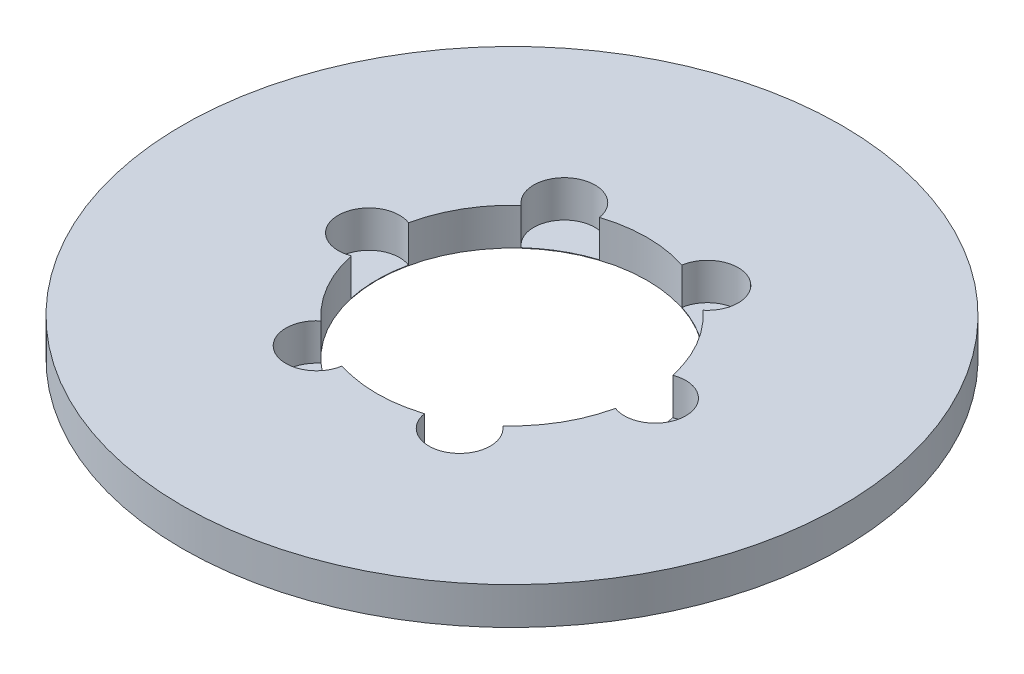
ISO-10303-21;
HEADER;
FILE_DESCRIPTION(('STEP AP214'),'2;1');
FILE_NAME('part.step','',(''),(''),'','','');
FILE_SCHEMA(('AUTOMOTIVE_DESIGN { 1 0 10303 214 1 1 1 1 }'));
ENDSEC;
DATA;
#1=APPLICATION_CONTEXT('core data for automotive mechanical design processes');
#2=APPLICATION_PROTOCOL_DEFINITION('international standard','automotive_design',2000,#1);
#3=PRODUCT_CONTEXT('',#1,'mechanical');
#4=PRODUCT('Part','Part','',(#3));
#5=PRODUCT_RELATED_PRODUCT_CATEGORY('part','',(#4));
#6=PRODUCT_DEFINITION_FORMATION('','',#4);
#7=PRODUCT_DEFINITION_CONTEXT('part definition',#1,'design');
#8=PRODUCT_DEFINITION('design','',#6,#7);
#9=PRODUCT_DEFINITION_SHAPE('','',#8);
#10=(LENGTH_UNIT() NAMED_UNIT(*) SI_UNIT(.MILLI.,.METRE.));
#11=(NAMED_UNIT(*) PLANE_ANGLE_UNIT() SI_UNIT($,.RADIAN.));
#12=(NAMED_UNIT(*) SI_UNIT($,.STERADIAN.) SOLID_ANGLE_UNIT());
#13=UNCERTAINTY_MEASURE_WITH_UNIT(LENGTH_MEASURE(1.E-05),#10,'distance_accuracy_value','');
#14=(GEOMETRIC_REPRESENTATION_CONTEXT(3) GLOBAL_UNCERTAINTY_ASSIGNED_CONTEXT((#13)) GLOBAL_UNIT_ASSIGNED_CONTEXT((#10,
#11,#12)) REPRESENTATION_CONTEXT('',''));
#15=CARTESIAN_POINT('',(0.,0.,0.));
#16=DIRECTION('',(0.,0.,1.));
#17=DIRECTION('',(1.,0.,0.));
#18=AXIS2_PLACEMENT_3D('',#15,#16,#17);
#19=CARTESIAN_POINT('',(0.,11.,0.));
#20=DIRECTION('',(0.,-1.,0.));
#21=DIRECTION('',(0.,0.,-1.));
#22=AXIS2_PLACEMENT_3D('',#19,#20,#21);
#23=CYLINDRICAL_SURFACE('',#22,97.5);
#24=CARTESIAN_POINT('',(0.,11.,0.));
#25=DIRECTION('',(0.,1.,0.));
#26=DIRECTION('',(0.,0.,1.));
#27=AXIS2_PLACEMENT_3D('',#24,#25,#26);
#28=CIRCLE('',#27,97.5);
#29=CARTESIAN_POINT('',(0.,11.,97.5));
#30=VERTEX_POINT('',#29);
#31=EDGE_CURVE('E171',#30,#30,#28,.T.);
#32=ORIENTED_EDGE('',*,*,#31,.F.);
#33=EDGE_LOOP('',(#32));
#34=FACE_BOUND('',#33,.T.);
#35=CARTESIAN_POINT('',(0.,0.,0.));
#36=DIRECTION('',(0.,1.,0.));
#37=DIRECTION('',(0.,0.,1.));
#38=AXIS2_PLACEMENT_3D('',#35,#36,#37);
#39=CIRCLE('',#38,97.5);
#40=CARTESIAN_POINT('',(0.,0.,97.5));
#41=VERTEX_POINT('',#40);
#42=EDGE_CURVE('E157',#41,#41,#39,.T.);
#43=ORIENTED_EDGE('',*,*,#42,.T.);
#44=EDGE_LOOP('',(#43));
#45=FACE_BOUND('',#44,.T.);
#46=ADVANCED_FACE('F39',(#34,#45),#23,.T.);
#47=CARTESIAN_POINT('',(0.,11.,0.));
#48=DIRECTION('',(0.,1.,0.));
#49=DIRECTION('',(0.,0.,1.));
#50=AXIS2_PLACEMENT_3D('',#47,#48,#49);
#51=PLANE('',#50);
#52=CARTESIAN_POINT('',(-21.1661389337115,11.,-36.660828033249));
#53=DIRECTION('',(0.,1.,0.));
#54=DIRECTION('',(-0.866025403784433,0.,0.50000000000001));
#55=AXIS2_PLACEMENT_3D('',#52,#53,#54);
#56=CIRCLE('',#55,9.07629285510067);
#57=CARTESIAN_POINT('',(-12.2035447762373,11.,-38.0929585999089));
#58=VERTEX_POINT('',#57);
#59=CARTESIAN_POINT('',(-26.887697464712,11.,-29.6150590923962));
#60=VERTEX_POINT('',#59);
#61=EDGE_CURVE('E214',#58,#60,#56,.T.);
#62=ORIENTED_EDGE('',*,*,#61,.F.);
#63=CARTESIAN_POINT('',(0.,11.,0.));
#64=DIRECTION('',(0.,1.,0.));
#65=DIRECTION('',(0.,0.,1.));
#66=AXIS2_PLACEMENT_3D('',#63,#64,#65);
#67=CIRCLE('',#66,40.);
#68=CARTESIAN_POINT('',(12.2035447762365,11.,-38.0929585999091));
#69=VERTEX_POINT('',#68);
#70=EDGE_CURVE('E272',#69,#58,#67,.T.);
#71=ORIENTED_EDGE('',*,*,#70,.F.);
#72=CARTESIAN_POINT('',(21.1661389337107,11.,-36.6608280332494));
#73=DIRECTION('',(0.,1.,0.));
#74=DIRECTION('',(-0.866025403784443,0.,-0.499999999999992));
#75=AXIS2_PLACEMENT_3D('',#72,#73,#74);
#76=CIRCLE('',#75,9.07629285510067);
#77=CARTESIAN_POINT('',(26.8876974647114,11.,-29.6150590923968));
#78=VERTEX_POINT('',#77);
#79=EDGE_CURVE('E285',#78,#69,#76,.T.);
#80=ORIENTED_EDGE('',*,*,#79,.F.);
#81=CARTESIAN_POINT('',(39.0912422409485,11.,-8.47789950751251));
#82=VERTEX_POINT('',#81);
#83=EDGE_CURVE('E165',#82,#78,#67,.T.);
#84=ORIENTED_EDGE('',*,*,#83,.F.);
#85=CARTESIAN_POINT('',(42.3322778674221,11.,0.));
#86=DIRECTION('',(0.,1.,0.));
#87=DIRECTION('',(0.,0.,-1.));
#88=AXIS2_PLACEMENT_3D('',#85,#86,#87);
#89=CIRCLE('',#88,9.07629285510067);
#90=CARTESIAN_POINT('',(39.0912422409485,11.,8.47789950751251));
#91=VERTEX_POINT('',#90);
#92=EDGE_CURVE('E281',#91,#82,#89,.T.);
#93=ORIENTED_EDGE('',*,*,#92,.F.);
#94=CARTESIAN_POINT('',(26.8876974647118,11.,29.6150590923964));
#95=VERTEX_POINT('',#94);
#96=EDGE_CURVE('E160',#95,#91,#67,.T.);
#97=ORIENTED_EDGE('',*,*,#96,.F.);
#98=CARTESIAN_POINT('',(21.1661389337112,11.,36.6608280332492));
#99=DIRECTION('',(0.,1.,0.));
#100=DIRECTION('',(0.866025403784436,0.,-0.500000000000004));
#101=AXIS2_PLACEMENT_3D('',#98,#99,#100);
#102=CIRCLE('',#101,9.07629285510067);
#103=CARTESIAN_POINT('',(12.203544776237,11.,38.092958599909));
#104=VERTEX_POINT('',#103);
#105=EDGE_CURVE('E154',#104,#95,#102,.T.);
#106=ORIENTED_EDGE('',*,*,#105,.F.);
#107=CARTESIAN_POINT('',(-12.2035447762368,11.,38.092958599909));
#108=VERTEX_POINT('',#107);
#109=EDGE_CURVE('E150',#108,#104,#67,.T.);
#110=ORIENTED_EDGE('',*,*,#109,.F.);
#111=CARTESIAN_POINT('',(-21.166138933711,11.,36.6608280332493));
#112=DIRECTION('',(0.,1.,0.));
#113=DIRECTION('',(0.86602540378444,0.,0.499999999999998));
#114=AXIS2_PLACEMENT_3D('',#111,#112,#113);
#115=CIRCLE('',#114,9.07629285510067);
#116=CARTESIAN_POINT('',(-26.8876974647116,11.,29.6150590923966));
#117=VERTEX_POINT('',#116);
#118=EDGE_CURVE('E127',#117,#108,#115,.T.);
#119=ORIENTED_EDGE('',*,*,#118,.F.);
#120=CARTESIAN_POINT('',(-39.0912422409485,11.,8.47789950751251));
#121=VERTEX_POINT('',#120);
#122=EDGE_CURVE('E156',#121,#117,#67,.T.);
#123=ORIENTED_EDGE('',*,*,#122,.F.);
#124=CARTESIAN_POINT('',(-42.3322778674221,11.,0.));
#125=DIRECTION('',(0.,1.,0.));
#126=DIRECTION('',(0.,0.,1.));
#127=AXIS2_PLACEMENT_3D('',#124,#125,#126);
#128=CIRCLE('',#127,9.07629285510067);
#129=CARTESIAN_POINT('',(-39.0912422409485,11.,-8.47789950751251));
#130=VERTEX_POINT('',#129);
#131=EDGE_CURVE('E164',#130,#121,#128,.T.);
#132=ORIENTED_EDGE('',*,*,#131,.F.);
#133=EDGE_CURVE('E159',#60,#130,#67,.T.);
#134=ORIENTED_EDGE('',*,*,#133,.F.);
#135=EDGE_LOOP('',(#62,#71,#80,#84,#93,#97,#106,#110,#119,#123,#132,#134));
#136=FACE_BOUND('',#135,.T.);
#137=ORIENTED_EDGE('',*,*,#31,.T.);
#138=EDGE_LOOP('',(#137));
#139=FACE_BOUND('',#138,.T.);
#140=ADVANCED_FACE('F155',(#136,#139),#51,.T.);
#141=CARTESIAN_POINT('',(0.,0.,0.));
#142=DIRECTION('',(0.,1.,0.));
#143=DIRECTION('',(0.,0.,1.));
#144=AXIS2_PLACEMENT_3D('',#141,#142,#143);
#145=PLANE('',#144);
#146=CARTESIAN_POINT('',(0.,0.,0.));
#147=DIRECTION('',(0.,1.,0.));
#148=DIRECTION('',(0.,0.,1.));
#149=AXIS2_PLACEMENT_3D('',#146,#147,#148);
#150=CIRCLE('',#149,40.);
#151=CARTESIAN_POINT('',(0.,0.,40.));
#152=VERTEX_POINT('',#151);
#153=EDGE_CURVE('E170',#152,#152,#150,.T.);
#154=ORIENTED_EDGE('',*,*,#153,.T.);
#155=EDGE_LOOP('',(#154));
#156=FACE_BOUND('',#155,.T.);
#157=ORIENTED_EDGE('',*,*,#42,.F.);
#158=EDGE_LOOP('',(#157));
#159=FACE_BOUND('',#158,.T.);
#160=ADVANCED_FACE('F232',(#156,#159),#145,.F.);
#161=CARTESIAN_POINT('',(0.,11.,0.));
#162=DIRECTION('',(0.,-1.,0.));
#163=DIRECTION('',(0.,0.,-1.));
#164=AXIS2_PLACEMENT_3D('',#161,#162,#163);
#165=CYLINDRICAL_SURFACE('',#164,40.);
#166=DIRECTION('',(0.,1.,0.));
#167=VECTOR('',#166,1.);
#168=CARTESIAN_POINT('',(-12.2035447762373,5.56726037191285,-38.0929585999089));
#169=LINE('',#168,#167);
#170=CARTESIAN_POINT('',(-12.2035447762373,0.134520743825707,-38.0929585999089));
#171=VERTEX_POINT('',#170);
#172=EDGE_CURVE('E11',#171,#58,#169,.T.);
#173=ORIENTED_EDGE('',*,*,#172,.F.);
#174=CARTESIAN_POINT('',(0.,0.134520743825707,0.));
#175=DIRECTION('',(0.,1.,0.));
#176=DIRECTION('',(0.,0.,1.));
#177=AXIS2_PLACEMENT_3D('',#174,#175,#176);
#178=CIRCLE('',#177,40.);
#179=CARTESIAN_POINT('',(-26.887697464712,0.134520743825707,-29.6150590923962));
#180=VERTEX_POINT('',#179);
#181=EDGE_CURVE('E209',#171,#180,#178,.T.);
#182=ORIENTED_EDGE('',*,*,#181,.T.);
#183=DIRECTION('',(0.,1.,0.));
#184=VECTOR('',#183,1.);
#185=CARTESIAN_POINT('',(-26.887697464712,5.56726037191285,-29.6150590923962));
#186=LINE('',#185,#184);
#187=EDGE_CURVE('E46',#60,#180,#186,.F.);
#188=ORIENTED_EDGE('',*,*,#187,.F.);
#189=ORIENTED_EDGE('',*,*,#133,.T.);
#190=DIRECTION('',(0.,1.,0.));
#191=VECTOR('',#190,1.);
#192=CARTESIAN_POINT('',(-39.0912422409485,5.56726037191285,-8.47789950751251));
#193=LINE('',#192,#191);
#194=CARTESIAN_POINT('',(-39.0912422409485,0.134520743825707,-8.47789950751251));
#195=VERTEX_POINT('',#194);
#196=EDGE_CURVE('E185',#195,#130,#193,.T.);
#197=ORIENTED_EDGE('',*,*,#196,.F.);
#198=CARTESIAN_POINT('',(0.,0.134520743825707,0.));
#199=DIRECTION('',(0.,1.,0.));
#200=DIRECTION('',(0.,0.,1.));
#201=AXIS2_PLACEMENT_3D('',#198,#199,#200);
#202=CIRCLE('',#201,40.);
#203=CARTESIAN_POINT('',(-39.0912422409485,0.134520743825707,8.47789950751251));
#204=VERTEX_POINT('',#203);
#205=EDGE_CURVE('E173',#195,#204,#202,.T.);
#206=ORIENTED_EDGE('',*,*,#205,.T.);
#207=DIRECTION('',(0.,1.,0.));
#208=VECTOR('',#207,1.);
#209=CARTESIAN_POINT('',(-39.0912422409485,5.56726037191285,8.47789950751251));
#210=LINE('',#209,#208);
#211=EDGE_CURVE('E178',#121,#204,#210,.F.);
#212=ORIENTED_EDGE('',*,*,#211,.F.);
#213=ORIENTED_EDGE('',*,*,#122,.T.);
#214=DIRECTION('',(0.,1.,0.));
#215=VECTOR('',#214,1.);
#216=CARTESIAN_POINT('',(-26.8876974647116,5.56726037191285,29.6150590923966));
#217=LINE('',#216,#215);
#218=CARTESIAN_POINT('',(-26.8876974647116,0.134520743825707,29.6150590923966));
#219=VERTEX_POINT('',#218);
#220=EDGE_CURVE('E132',#219,#117,#217,.T.);
#221=ORIENTED_EDGE('',*,*,#220,.F.);
#222=CARTESIAN_POINT('',(0.,0.134520743825707,0.));
#223=DIRECTION('',(0.,1.,0.));
#224=DIRECTION('',(0.,0.,1.));
#225=AXIS2_PLACEMENT_3D('',#222,#223,#224);
#226=CIRCLE('',#225,40.);
#227=CARTESIAN_POINT('',(-12.2035447762368,0.134520743825707,38.092958599909));
#228=VERTEX_POINT('',#227);
#229=EDGE_CURVE('E146',#219,#228,#226,.T.);
#230=ORIENTED_EDGE('',*,*,#229,.T.);
#231=DIRECTION('',(0.,1.,0.));
#232=VECTOR('',#231,1.);
#233=CARTESIAN_POINT('',(-12.2035447762368,5.56726037191285,38.092958599909));
#234=LINE('',#233,#232);
#235=EDGE_CURVE('E128',#108,#228,#234,.F.);
#236=ORIENTED_EDGE('',*,*,#235,.F.);
#237=ORIENTED_EDGE('',*,*,#109,.T.);
#238=DIRECTION('',(0.,1.,0.));
#239=VECTOR('',#238,1.);
#240=CARTESIAN_POINT('',(12.203544776237,5.56726037191285,38.092958599909));
#241=LINE('',#240,#239);
#242=CARTESIAN_POINT('',(12.203544776237,0.134520743825707,38.092958599909));
#243=VERTEX_POINT('',#242);
#244=EDGE_CURVE('E192',#243,#104,#241,.T.);
#245=ORIENTED_EDGE('',*,*,#244,.F.);
#246=CARTESIAN_POINT('',(0.,0.134520743825707,0.));
#247=DIRECTION('',(0.,1.,0.));
#248=DIRECTION('',(0.,0.,1.));
#249=AXIS2_PLACEMENT_3D('',#246,#247,#248);
#250=CIRCLE('',#249,40.);
#251=CARTESIAN_POINT('',(26.8876974647118,0.134520743825707,29.6150590923964));
#252=VERTEX_POINT('',#251);
#253=EDGE_CURVE('E190',#243,#252,#250,.T.);
#254=ORIENTED_EDGE('',*,*,#253,.T.);
#255=DIRECTION('',(0.,1.,0.));
#256=VECTOR('',#255,1.);
#257=CARTESIAN_POINT('',(26.8876974647118,5.56726037191285,29.6150590923964));
#258=LINE('',#257,#256);
#259=EDGE_CURVE('E189',#95,#252,#258,.F.);
#260=ORIENTED_EDGE('',*,*,#259,.F.);
#261=ORIENTED_EDGE('',*,*,#96,.T.);
#262=DIRECTION('',(0.,1.,0.));
#263=VECTOR('',#262,1.);
#264=CARTESIAN_POINT('',(39.0912422409485,5.56726037191285,8.47789950751251));
#265=LINE('',#264,#263);
#266=CARTESIAN_POINT('',(39.0912422409485,0.134520743825707,8.47789950751251));
#267=VERTEX_POINT('',#266);
#268=EDGE_CURVE('E203',#267,#91,#265,.T.);
#269=ORIENTED_EDGE('',*,*,#268,.F.);
#270=CARTESIAN_POINT('',(0.,0.134520743825707,0.));
#271=DIRECTION('',(0.,1.,0.));
#272=DIRECTION('',(0.,0.,1.));
#273=AXIS2_PLACEMENT_3D('',#270,#271,#272);
#274=CIRCLE('',#273,40.);
#275=CARTESIAN_POINT('',(39.0912422409485,0.134520743825707,-8.47789950751251));
#276=VERTEX_POINT('',#275);
#277=EDGE_CURVE('E194',#267,#276,#274,.T.);
#278=ORIENTED_EDGE('',*,*,#277,.T.);
#279=DIRECTION('',(0.,1.,0.));
#280=VECTOR('',#279,1.);
#281=CARTESIAN_POINT('',(39.0912422409485,5.56726037191285,-8.47789950751251));
#282=LINE('',#281,#280);
#283=EDGE_CURVE('E196',#82,#276,#282,.F.);
#284=ORIENTED_EDGE('',*,*,#283,.F.);
#285=ORIENTED_EDGE('',*,*,#83,.T.);
#286=DIRECTION('',(0.,1.,0.));
#287=VECTOR('',#286,1.);
#288=CARTESIAN_POINT('',(26.8876974647114,5.56726037191285,-29.6150590923968));
#289=LINE('',#288,#287);
#290=CARTESIAN_POINT('',(26.8876974647114,0.134520743825707,-29.6150590923968));
#291=VERTEX_POINT('',#290);
#292=EDGE_CURVE('E208',#291,#78,#289,.T.);
#293=ORIENTED_EDGE('',*,*,#292,.F.);
#294=CARTESIAN_POINT('',(0.,0.134520743825707,0.));
#295=DIRECTION('',(0.,1.,0.));
#296=DIRECTION('',(0.,0.,1.));
#297=AXIS2_PLACEMENT_3D('',#294,#295,#296);
#298=CIRCLE('',#297,40.);
#299=CARTESIAN_POINT('',(12.2035447762365,0.134520743825707,-38.0929585999091));
#300=VERTEX_POINT('',#299);
#301=EDGE_CURVE('E201',#291,#300,#298,.T.);
#302=ORIENTED_EDGE('',*,*,#301,.T.);
#303=DIRECTION('',(0.,1.,0.));
#304=VECTOR('',#303,1.);
#305=CARTESIAN_POINT('',(12.2035447762365,5.56726037191285,-38.0929585999091));
#306=LINE('',#305,#304);
#307=EDGE_CURVE('E206',#69,#300,#306,.F.);
#308=ORIENTED_EDGE('',*,*,#307,.F.);
#309=ORIENTED_EDGE('',*,*,#70,.T.);
#310=EDGE_LOOP('',(#173,#182,#188,#189,#197,#206,#212,#213,#221,#230,#236,#237,#245,#254,#260,
#261,#269,#278,#284,#285,#293,#302,#308,#309));
#311=FACE_BOUND('',#310,.T.);
#312=ORIENTED_EDGE('',*,*,#153,.F.);
#313=EDGE_LOOP('',(#312));
#314=FACE_BOUND('',#313,.T.);
#315=ADVANCED_FACE('F145',(#311,#314),#165,.F.);
#316=CARTESIAN_POINT('',(-42.3322778674221,0.134520743825707,0.));
#317=DIRECTION('',(0.,1.,0.));
#318=DIRECTION('',(0.,0.,1.));
#319=AXIS2_PLACEMENT_3D('',#316,#317,#318);
#320=CYLINDRICAL_SURFACE('',#319,9.07629285510067);
#321=ORIENTED_EDGE('',*,*,#196,.T.);
#322=ORIENTED_EDGE('',*,*,#131,.T.);
#323=ORIENTED_EDGE('',*,*,#211,.T.);
#324=CARTESIAN_POINT('',(-42.3322778674221,0.134520743825707,0.));
#325=DIRECTION('',(0.,1.,0.));
#326=DIRECTION('',(0.,0.,1.));
#327=AXIS2_PLACEMENT_3D('',#324,#325,#326);
#328=CIRCLE('',#327,9.07629285510067);
#329=EDGE_CURVE('E168',#195,#204,#328,.T.);
#330=ORIENTED_EDGE('',*,*,#329,.F.);
#331=EDGE_LOOP('',(#321,#322,#323,#330));
#332=FACE_BOUND('',#331,.T.);
#333=ADVANCED_FACE('F243',(#332),#320,.F.);
#334=CARTESIAN_POINT('',(-42.3322778674221,0.134520743825707,0.));
#335=DIRECTION('',(0.,1.,0.));
#336=DIRECTION('',(0.,0.,1.));
#337=AXIS2_PLACEMENT_3D('',#334,#335,#336);
#338=PLANE('',#337);
#339=ORIENTED_EDGE('',*,*,#329,.T.);
#340=ORIENTED_EDGE('',*,*,#205,.F.);
#341=EDGE_LOOP('',(#339,#340));
#342=FACE_BOUND('',#341,.T.);
#343=ADVANCED_FACE('F247',(#342),#338,.T.);
#344=CARTESIAN_POINT('',(-21.166138933711,0.134520743825707,36.6608280332493));
#345=DIRECTION('',(0.,1.,0.));
#346=DIRECTION('',(0.,0.,1.));
#347=AXIS2_PLACEMENT_3D('',#344,#345,#346);
#348=CYLINDRICAL_SURFACE('',#347,9.07629285510067);
#349=ORIENTED_EDGE('',*,*,#220,.T.);
#350=ORIENTED_EDGE('',*,*,#118,.T.);
#351=ORIENTED_EDGE('',*,*,#235,.T.);
#352=CARTESIAN_POINT('',(-21.166138933711,0.134520743825707,36.6608280332493));
#353=DIRECTION('',(0.,1.,0.));
#354=DIRECTION('',(0.86602540378444,0.,0.499999999999998));
#355=AXIS2_PLACEMENT_3D('',#352,#353,#354);
#356=CIRCLE('',#355,9.07629285510067);
#357=EDGE_CURVE('E137',#219,#228,#356,.T.);
#358=ORIENTED_EDGE('',*,*,#357,.F.);
#359=EDGE_LOOP('',(#349,#350,#351,#358));
#360=FACE_BOUND('',#359,.T.);
#361=ADVANCED_FACE('F126',(#360),#348,.F.);
#362=CARTESIAN_POINT('',(-21.166138933711,0.134520743825707,36.6608280332493));
#363=DIRECTION('',(0.,1.,0.));
#364=DIRECTION('',(0.86602540378444,0.,0.499999999999998));
#365=AXIS2_PLACEMENT_3D('',#362,#363,#364);
#366=PLANE('',#365);
#367=ORIENTED_EDGE('',*,*,#357,.T.);
#368=ORIENTED_EDGE('',*,*,#229,.F.);
#369=EDGE_LOOP('',(#367,#368));
#370=FACE_BOUND('',#369,.T.);
#371=ADVANCED_FACE('F254',(#370),#366,.T.);
#372=CARTESIAN_POINT('',(21.1661389337112,0.134520743825707,36.6608280332492));
#373=DIRECTION('',(0.,1.,0.));
#374=DIRECTION('',(0.,0.,1.));
#375=AXIS2_PLACEMENT_3D('',#372,#373,#374);
#376=CYLINDRICAL_SURFACE('',#375,9.07629285510067);
#377=ORIENTED_EDGE('',*,*,#244,.T.);
#378=ORIENTED_EDGE('',*,*,#105,.T.);
#379=ORIENTED_EDGE('',*,*,#259,.T.);
#380=CARTESIAN_POINT('',(21.1661389337112,0.134520743825707,36.6608280332492));
#381=DIRECTION('',(0.,1.,0.));
#382=DIRECTION('',(0.866025403784436,0.,-0.500000000000004));
#383=AXIS2_PLACEMENT_3D('',#380,#381,#382);
#384=CIRCLE('',#383,9.07629285510067);
#385=EDGE_CURVE('E138',#243,#252,#384,.T.);
#386=ORIENTED_EDGE('',*,*,#385,.F.);
#387=EDGE_LOOP('',(#377,#378,#379,#386));
#388=FACE_BOUND('',#387,.T.);
#389=ADVANCED_FACE('F260',(#388),#376,.F.);
#390=CARTESIAN_POINT('',(21.1661389337112,0.134520743825707,36.6608280332492));
#391=DIRECTION('',(0.,1.,0.));
#392=DIRECTION('',(0.866025403784436,0.,-0.500000000000004));
#393=AXIS2_PLACEMENT_3D('',#390,#391,#392);
#394=PLANE('',#393);
#395=ORIENTED_EDGE('',*,*,#385,.T.);
#396=ORIENTED_EDGE('',*,*,#253,.F.);
#397=EDGE_LOOP('',(#395,#396));
#398=FACE_BOUND('',#397,.T.);
#399=ADVANCED_FACE('F265',(#398),#394,.T.);
#400=CARTESIAN_POINT('',(42.3322778674221,0.134520743825707,0.));
#401=DIRECTION('',(0.,1.,0.));
#402=DIRECTION('',(0.,0.,1.));
#403=AXIS2_PLACEMENT_3D('',#400,#401,#402);
#404=CYLINDRICAL_SURFACE('',#403,9.07629285510067);
#405=ORIENTED_EDGE('',*,*,#268,.T.);
#406=ORIENTED_EDGE('',*,*,#92,.T.);
#407=ORIENTED_EDGE('',*,*,#283,.T.);
#408=CARTESIAN_POINT('',(42.3322778674221,0.134520743825707,0.));
#409=DIRECTION('',(0.,1.,0.));
#410=DIRECTION('',(0.,0.,-1.));
#411=AXIS2_PLACEMENT_3D('',#408,#409,#410);
#412=CIRCLE('',#411,9.07629285510067);
#413=EDGE_CURVE('E287',#267,#276,#412,.T.);
#414=ORIENTED_EDGE('',*,*,#413,.F.);
#415=EDGE_LOOP('',(#405,#406,#407,#414));
#416=FACE_BOUND('',#415,.T.);
#417=ADVANCED_FACE('F300',(#416),#404,.F.);
#418=CARTESIAN_POINT('',(42.3322778674221,0.134520743825707,0.));
#419=DIRECTION('',(0.,1.,0.));
#420=DIRECTION('',(0.,0.,-1.));
#421=AXIS2_PLACEMENT_3D('',#418,#419,#420);
#422=PLANE('',#421);
#423=ORIENTED_EDGE('',*,*,#413,.T.);
#424=ORIENTED_EDGE('',*,*,#277,.F.);
#425=EDGE_LOOP('',(#423,#424));
#426=FACE_BOUND('',#425,.T.);
#427=ADVANCED_FACE('F298',(#426),#422,.T.);
#428=CARTESIAN_POINT('',(21.1661389337107,0.134520743825707,-36.6608280332494));
#429=DIRECTION('',(0.,1.,0.));
#430=DIRECTION('',(0.,0.,1.));
#431=AXIS2_PLACEMENT_3D('',#428,#429,#430);
#432=CYLINDRICAL_SURFACE('',#431,9.07629285510067);
#433=ORIENTED_EDGE('',*,*,#292,.T.);
#434=ORIENTED_EDGE('',*,*,#79,.T.);
#435=ORIENTED_EDGE('',*,*,#307,.T.);
#436=CARTESIAN_POINT('',(21.1661389337107,0.134520743825707,-36.6608280332494));
#437=DIRECTION('',(0.,1.,0.));
#438=DIRECTION('',(-0.866025403784443,0.,-0.499999999999992));
#439=AXIS2_PLACEMENT_3D('',#436,#437,#438);
#440=CIRCLE('',#439,9.07629285510067);
#441=EDGE_CURVE('E56',#291,#300,#440,.T.);
#442=ORIENTED_EDGE('',*,*,#441,.F.);
#443=EDGE_LOOP('',(#433,#434,#435,#442));
#444=FACE_BOUND('',#443,.T.);
#445=ADVANCED_FACE('F301',(#444),#432,.F.);
#446=CARTESIAN_POINT('',(21.1661389337107,0.134520743825707,-36.6608280332494));
#447=DIRECTION('',(0.,1.,0.));
#448=DIRECTION('',(-0.866025403784443,0.,-0.499999999999992));
#449=AXIS2_PLACEMENT_3D('',#446,#447,#448);
#450=PLANE('',#449);
#451=ORIENTED_EDGE('',*,*,#441,.T.);
#452=ORIENTED_EDGE('',*,*,#301,.F.);
#453=EDGE_LOOP('',(#451,#452));
#454=FACE_BOUND('',#453,.T.);
#455=ADVANCED_FACE('F221',(#454),#450,.T.);
#456=CARTESIAN_POINT('',(-21.1661389337115,0.134520743825707,-36.660828033249));
#457=DIRECTION('',(0.,1.,0.));
#458=DIRECTION('',(0.,0.,1.));
#459=AXIS2_PLACEMENT_3D('',#456,#457,#458);
#460=CYLINDRICAL_SURFACE('',#459,9.07629285510067);
#461=ORIENTED_EDGE('',*,*,#172,.T.);
#462=ORIENTED_EDGE('',*,*,#61,.T.);
#463=ORIENTED_EDGE('',*,*,#187,.T.);
#464=CARTESIAN_POINT('',(-21.1661389337115,0.134520743825707,-36.660828033249));
#465=DIRECTION('',(0.,1.,0.));
#466=DIRECTION('',(-0.866025403784433,0.,0.50000000000001));
#467=AXIS2_PLACEMENT_3D('',#464,#465,#466);
#468=CIRCLE('',#467,9.07629285510067);
#469=EDGE_CURVE('E55',#171,#180,#468,.T.);
#470=ORIENTED_EDGE('',*,*,#469,.F.);
#471=EDGE_LOOP('',(#461,#462,#463,#470));
#472=FACE_BOUND('',#471,.T.);
#473=ADVANCED_FACE('F212',(#472),#460,.F.);
#474=CARTESIAN_POINT('',(-21.1661389337115,0.134520743825707,-36.660828033249));
#475=DIRECTION('',(0.,1.,0.));
#476=DIRECTION('',(-0.866025403784433,0.,0.50000000000001));
#477=AXIS2_PLACEMENT_3D('',#474,#475,#476);
#478=PLANE('',#477);
#479=ORIENTED_EDGE('',*,*,#469,.T.);
#480=ORIENTED_EDGE('',*,*,#181,.F.);
#481=EDGE_LOOP('',(#479,#480));
#482=FACE_BOUND('',#481,.T.);
#483=ADVANCED_FACE('F217',(#482),#478,.T.);
#484=CLOSED_SHELL('',(#46,#140,#160,#315,#333,#343,#361,#371,#389,#399,#417,#427,#445,#455,#473,#483));
#485=MANIFOLD_SOLID_BREP('B2',#484);
#486=ADVANCED_BREP_SHAPE_REPRESENTATION('',(#18,#485),#14);
#487=SHAPE_DEFINITION_REPRESENTATION(#9,#486);
ENDSEC;
END-ISO-10303-21;
